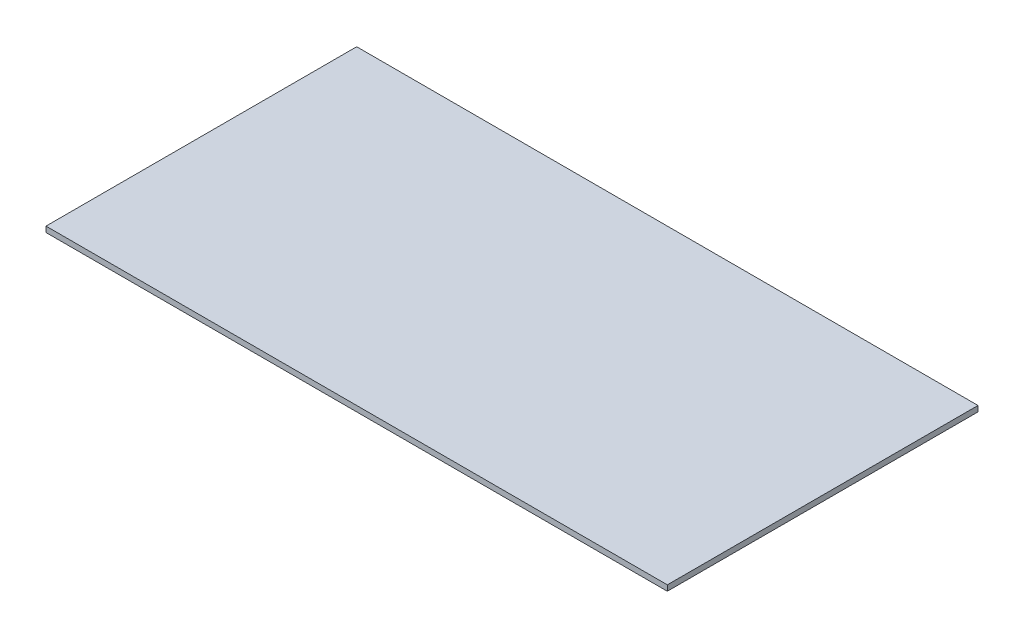
ISO-10303-21;
HEADER;
FILE_DESCRIPTION(('STEP AP214'),'2;1');
FILE_NAME('part.step','',(''),(''),'','','');
FILE_SCHEMA(('AUTOMOTIVE_DESIGN { 1 0 10303 214 1 1 1 1 }'));
ENDSEC;
DATA;
#1=APPLICATION_CONTEXT('core data for automotive mechanical design processes');
#2=APPLICATION_PROTOCOL_DEFINITION('international standard','automotive_design',2000,#1);
#3=PRODUCT_CONTEXT('',#1,'mechanical');
#4=PRODUCT('Part','Part','',(#3));
#5=PRODUCT_RELATED_PRODUCT_CATEGORY('part','',(#4));
#6=PRODUCT_DEFINITION_FORMATION('','',#4);
#7=PRODUCT_DEFINITION_CONTEXT('part definition',#1,'design');
#8=PRODUCT_DEFINITION('design','',#6,#7);
#9=PRODUCT_DEFINITION_SHAPE('','',#8);
#10=(LENGTH_UNIT() NAMED_UNIT(*) SI_UNIT(.MILLI.,.METRE.));
#11=(NAMED_UNIT(*) PLANE_ANGLE_UNIT() SI_UNIT($,.RADIAN.));
#12=(NAMED_UNIT(*) SI_UNIT($,.STERADIAN.) SOLID_ANGLE_UNIT());
#13=UNCERTAINTY_MEASURE_WITH_UNIT(LENGTH_MEASURE(1.E-05),#10,'distance_accuracy_value','');
#14=(GEOMETRIC_REPRESENTATION_CONTEXT(3) GLOBAL_UNCERTAINTY_ASSIGNED_CONTEXT((#13)) GLOBAL_UNIT_ASSIGNED_CONTEXT((#10,
#11,#12)) REPRESENTATION_CONTEXT('',''));
#15=CARTESIAN_POINT('',(0.,0.,0.));
#16=DIRECTION('',(0.,0.,1.));
#17=DIRECTION('',(1.,0.,0.));
#18=AXIS2_PLACEMENT_3D('',#15,#16,#17);
#19=CARTESIAN_POINT('',(0.,0.45,0.));
#20=DIRECTION('',(1.,0.,0.));
#21=DIRECTION('',(0.,0.,-1.));
#22=AXIS2_PLACEMENT_3D('',#19,#20,#21);
#23=PLANE('',#22);
#24=DIRECTION('',(0.,0.,1.));
#25=VECTOR('',#24,1.);
#26=CARTESIAN_POINT('',(0.,0.,0.));
#27=LINE('',#26,#25);
#28=CARTESIAN_POINT('',(0.,0.,-25.));
#29=VERTEX_POINT('',#28);
#30=CARTESIAN_POINT('',(0.,0.,0.));
#31=VERTEX_POINT('',#30);
#32=EDGE_CURVE('E96',#29,#31,#27,.T.);
#33=ORIENTED_EDGE('',*,*,#32,.T.);
#34=DIRECTION('',(0.,-1.,0.));
#35=VECTOR('',#34,1.);
#36=CARTESIAN_POINT('',(0.,0.45,0.));
#37=LINE('',#36,#35);
#38=CARTESIAN_POINT('',(0.,0.45,0.));
#39=VERTEX_POINT('',#38);
#40=EDGE_CURVE('E11',#39,#31,#37,.T.);
#41=ORIENTED_EDGE('',*,*,#40,.F.);
#42=DIRECTION('',(0.,0.,1.));
#43=VECTOR('',#42,1.);
#44=CARTESIAN_POINT('',(0.,0.45,0.));
#45=LINE('',#44,#43);
#46=CARTESIAN_POINT('',(0.,0.45,-25.));
#47=VERTEX_POINT('',#46);
#48=EDGE_CURVE('E84',#47,#39,#45,.T.);
#49=ORIENTED_EDGE('',*,*,#48,.F.);
#50=DIRECTION('',(0.,-1.,0.));
#51=VECTOR('',#50,1.);
#52=CARTESIAN_POINT('',(0.,0.45,-25.));
#53=LINE('',#52,#51);
#54=EDGE_CURVE('E92',#47,#29,#53,.T.);
#55=ORIENTED_EDGE('',*,*,#54,.T.);
#56=EDGE_LOOP('',(#33,#41,#49,#55));
#57=FACE_BOUND('',#56,.T.);
#58=ADVANCED_FACE('F33',(#57),#23,.F.);
#59=CARTESIAN_POINT('',(0.,0.45,0.));
#60=DIRECTION('',(0.,0.,-1.));
#61=DIRECTION('',(-1.,0.,0.));
#62=AXIS2_PLACEMENT_3D('',#59,#60,#61);
#63=PLANE('',#62);
#64=DIRECTION('',(1.,0.,0.));
#65=VECTOR('',#64,1.);
#66=CARTESIAN_POINT('',(0.,0.,0.));
#67=LINE('',#66,#65);
#68=CARTESIAN_POINT('',(50.,0.,0.));
#69=VERTEX_POINT('',#68);
#70=EDGE_CURVE('E88',#31,#69,#67,.T.);
#71=ORIENTED_EDGE('',*,*,#70,.T.);
#72=DIRECTION('',(0.,-1.,0.));
#73=VECTOR('',#72,1.);
#74=CARTESIAN_POINT('',(50.,0.45,0.));
#75=LINE('',#74,#73);
#76=CARTESIAN_POINT('',(50.,0.45,0.));
#77=VERTEX_POINT('',#76);
#78=EDGE_CURVE('E41',#77,#69,#75,.T.);
#79=ORIENTED_EDGE('',*,*,#78,.F.);
#80=DIRECTION('',(1.,0.,0.));
#81=VECTOR('',#80,1.);
#82=CARTESIAN_POINT('',(0.,0.45,0.));
#83=LINE('',#82,#81);
#84=EDGE_CURVE('E79',#39,#77,#83,.T.);
#85=ORIENTED_EDGE('',*,*,#84,.F.);
#86=ORIENTED_EDGE('',*,*,#40,.T.);
#87=EDGE_LOOP('',(#71,#79,#85,#86));
#88=FACE_BOUND('',#87,.T.);
#89=ADVANCED_FACE('F87',(#88),#63,.F.);
#90=CARTESIAN_POINT('',(50.,0.45,0.));
#91=DIRECTION('',(-1.,0.,0.));
#92=DIRECTION('',(0.,0.,1.));
#93=AXIS2_PLACEMENT_3D('',#90,#91,#92);
#94=PLANE('',#93);
#95=DIRECTION('',(0.,0.,-1.));
#96=VECTOR('',#95,1.);
#97=CARTESIAN_POINT('',(50.,0.,0.));
#98=LINE('',#97,#96);
#99=CARTESIAN_POINT('',(50.,0.,-25.));
#100=VERTEX_POINT('',#99);
#101=EDGE_CURVE('E66',#69,#100,#98,.T.);
#102=ORIENTED_EDGE('',*,*,#101,.T.);
#103=DIRECTION('',(0.,-1.,0.));
#104=VECTOR('',#103,1.);
#105=CARTESIAN_POINT('',(50.,0.45,-25.));
#106=LINE('',#105,#104);
#107=CARTESIAN_POINT('',(50.,0.45,-25.));
#108=VERTEX_POINT('',#107);
#109=EDGE_CURVE('E89',#108,#100,#106,.T.);
#110=ORIENTED_EDGE('',*,*,#109,.F.);
#111=DIRECTION('',(0.,0.,-1.));
#112=VECTOR('',#111,1.);
#113=CARTESIAN_POINT('',(50.,0.45,0.));
#114=LINE('',#113,#112);
#115=EDGE_CURVE('E82',#77,#108,#114,.T.);
#116=ORIENTED_EDGE('',*,*,#115,.F.);
#117=ORIENTED_EDGE('',*,*,#78,.T.);
#118=EDGE_LOOP('',(#102,#110,#116,#117));
#119=FACE_BOUND('',#118,.T.);
#120=ADVANCED_FACE('F90',(#119),#94,.F.);
#121=CARTESIAN_POINT('',(0.,0.45,-25.));
#122=DIRECTION('',(0.,0.,1.));
#123=DIRECTION('',(1.,0.,0.));
#124=AXIS2_PLACEMENT_3D('',#121,#122,#123);
#125=PLANE('',#124);
#126=DIRECTION('',(-1.,0.,0.));
#127=VECTOR('',#126,1.);
#128=CARTESIAN_POINT('',(0.,0.,-25.));
#129=LINE('',#128,#127);
#130=EDGE_CURVE('E72',#100,#29,#129,.T.);
#131=ORIENTED_EDGE('',*,*,#130,.T.);
#132=ORIENTED_EDGE('',*,*,#54,.F.);
#133=DIRECTION('',(-1.,0.,0.));
#134=VECTOR('',#133,1.);
#135=CARTESIAN_POINT('',(0.,0.45,-25.));
#136=LINE('',#135,#134);
#137=EDGE_CURVE('E49',#108,#47,#136,.T.);
#138=ORIENTED_EDGE('',*,*,#137,.F.);
#139=ORIENTED_EDGE('',*,*,#109,.T.);
#140=EDGE_LOOP('',(#131,#132,#138,#139));
#141=FACE_BOUND('',#140,.T.);
#142=ADVANCED_FACE('F103',(#141),#125,.F.);
#143=CARTESIAN_POINT('',(0.,0.45,0.));
#144=DIRECTION('',(0.,-1.,0.));
#145=DIRECTION('',(0.,0.,-1.));
#146=AXIS2_PLACEMENT_3D('',#143,#144,#145);
#147=PLANE('',#146);
#148=ORIENTED_EDGE('',*,*,#48,.T.);
#149=ORIENTED_EDGE('',*,*,#84,.T.);
#150=ORIENTED_EDGE('',*,*,#115,.T.);
#151=ORIENTED_EDGE('',*,*,#137,.T.);
#152=EDGE_LOOP('',(#148,#149,#150,#151));
#153=FACE_BOUND('',#152,.T.);
#154=ADVANCED_FACE('F80',(#153),#147,.F.);
#155=CARTESIAN_POINT('',(0.,0.,0.));
#156=DIRECTION('',(0.,-1.,0.));
#157=DIRECTION('',(0.,0.,-1.));
#158=AXIS2_PLACEMENT_3D('',#155,#156,#157);
#159=PLANE('',#158);
#160=ORIENTED_EDGE('',*,*,#32,.F.);
#161=ORIENTED_EDGE('',*,*,#130,.F.);
#162=ORIENTED_EDGE('',*,*,#101,.F.);
#163=ORIENTED_EDGE('',*,*,#70,.F.);
#164=EDGE_LOOP('',(#160,#161,#162,#163));
#165=FACE_BOUND('',#164,.T.);
#166=ADVANCED_FACE('F106',(#165),#159,.T.);
#167=CLOSED_SHELL('',(#58,#89,#120,#142,#154,#166));
#168=MANIFOLD_SOLID_BREP('B2',#167);
#169=ADVANCED_BREP_SHAPE_REPRESENTATION('',(#18,#168),#14);
#170=SHAPE_DEFINITION_REPRESENTATION(#9,#169);
ENDSEC;
END-ISO-10303-21;
